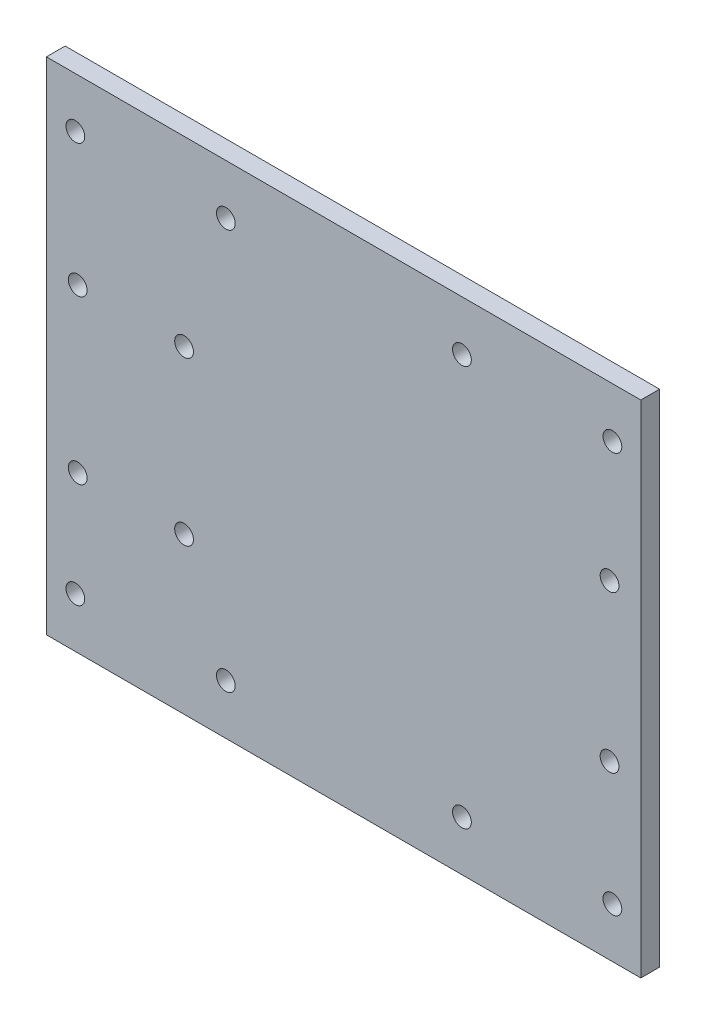
ISO-10303-21;
HEADER;
FILE_DESCRIPTION(('STEP AP214'),'2;1');
FILE_NAME('part.step','',(''),(''),'','','');
FILE_SCHEMA(('AUTOMOTIVE_DESIGN { 1 0 10303 214 1 1 1 1 }'));
ENDSEC;
DATA;
#1=APPLICATION_CONTEXT('core data for automotive mechanical design processes');
#2=APPLICATION_PROTOCOL_DEFINITION('international standard','automotive_design',2000,#1);
#3=PRODUCT_CONTEXT('',#1,'mechanical');
#4=PRODUCT('Part','Part','',(#3));
#5=PRODUCT_RELATED_PRODUCT_CATEGORY('part','',(#4));
#6=PRODUCT_DEFINITION_FORMATION('','',#4);
#7=PRODUCT_DEFINITION_CONTEXT('part definition',#1,'design');
#8=PRODUCT_DEFINITION('design','',#6,#7);
#9=PRODUCT_DEFINITION_SHAPE('','',#8);
#10=(LENGTH_UNIT() NAMED_UNIT(*) SI_UNIT(.MILLI.,.METRE.));
#11=(NAMED_UNIT(*) PLANE_ANGLE_UNIT() SI_UNIT($,.RADIAN.));
#12=(NAMED_UNIT(*) SI_UNIT($,.STERADIAN.) SOLID_ANGLE_UNIT());
#13=UNCERTAINTY_MEASURE_WITH_UNIT(LENGTH_MEASURE(1.E-05),#10,'distance_accuracy_value','');
#14=(GEOMETRIC_REPRESENTATION_CONTEXT(3) GLOBAL_UNCERTAINTY_ASSIGNED_CONTEXT((#13)) GLOBAL_UNIT_ASSIGNED_CONTEXT((#10,
#11,#12)) REPRESENTATION_CONTEXT('',''));
#15=CARTESIAN_POINT('',(0.,0.,0.));
#16=DIRECTION('',(0.,0.,1.));
#17=DIRECTION('',(1.,0.,0.));
#18=AXIS2_PLACEMENT_3D('',#15,#16,#17);
#19=CARTESIAN_POINT('',(47.5,-40.,3.));
#20=DIRECTION('',(-1.,0.,0.));
#21=DIRECTION('',(0.,0.,1.));
#22=AXIS2_PLACEMENT_3D('',#19,#20,#21);
#23=PLANE('',#22);
#24=DIRECTION('',(0.,1.,0.));
#25=VECTOR('',#24,1.);
#26=CARTESIAN_POINT('',(47.5,-40.,0.));
#27=LINE('',#26,#25);
#28=CARTESIAN_POINT('',(47.5,-40.,0.));
#29=VERTEX_POINT('',#28);
#30=CARTESIAN_POINT('',(47.5,40.,0.));
#31=VERTEX_POINT('',#30);
#32=EDGE_CURVE('E100',#29,#31,#27,.T.);
#33=ORIENTED_EDGE('',*,*,#32,.T.);
#34=DIRECTION('',(0.,0.,-1.));
#35=VECTOR('',#34,1.);
#36=CARTESIAN_POINT('',(47.5,40.,3.));
#37=LINE('',#36,#35);
#38=CARTESIAN_POINT('',(47.5,40.,3.));
#39=VERTEX_POINT('',#38);
#40=EDGE_CURVE('E11',#39,#31,#37,.T.);
#41=ORIENTED_EDGE('',*,*,#40,.F.);
#42=DIRECTION('',(0.,1.,0.));
#43=VECTOR('',#42,1.);
#44=CARTESIAN_POINT('',(47.5,-40.,3.));
#45=LINE('',#44,#43);
#46=CARTESIAN_POINT('',(47.5,-40.,3.));
#47=VERTEX_POINT('',#46);
#48=EDGE_CURVE('E88',#47,#39,#45,.T.);
#49=ORIENTED_EDGE('',*,*,#48,.F.);
#50=DIRECTION('',(0.,0.,-1.));
#51=VECTOR('',#50,1.);
#52=CARTESIAN_POINT('',(47.5,-40.,3.));
#53=LINE('',#52,#51);
#54=EDGE_CURVE('E96',#47,#29,#53,.T.);
#55=ORIENTED_EDGE('',*,*,#54,.T.);
#56=EDGE_LOOP('',(#33,#41,#49,#55));
#57=FACE_BOUND('',#56,.T.);
#58=ADVANCED_FACE('F37',(#57),#23,.F.);
#59=CARTESIAN_POINT('',(-47.5,40.,3.));
#60=DIRECTION('',(0.,-1.,0.));
#61=DIRECTION('',(0.,0.,-1.));
#62=AXIS2_PLACEMENT_3D('',#59,#60,#61);
#63=PLANE('',#62);
#64=DIRECTION('',(-1.,0.,0.));
#65=VECTOR('',#64,1.);
#66=CARTESIAN_POINT('',(-47.5,40.,0.));
#67=LINE('',#66,#65);
#68=CARTESIAN_POINT('',(-47.5,40.,0.));
#69=VERTEX_POINT('',#68);
#70=EDGE_CURVE('E92',#31,#69,#67,.T.);
#71=ORIENTED_EDGE('',*,*,#70,.T.);
#72=DIRECTION('',(0.,0.,-1.));
#73=VECTOR('',#72,1.);
#74=CARTESIAN_POINT('',(-47.5,40.,3.));
#75=LINE('',#74,#73);
#76=CARTESIAN_POINT('',(-47.5,40.,3.));
#77=VERTEX_POINT('',#76);
#78=EDGE_CURVE('E45',#77,#69,#75,.T.);
#79=ORIENTED_EDGE('',*,*,#78,.F.);
#80=DIRECTION('',(-1.,0.,0.));
#81=VECTOR('',#80,1.);
#82=CARTESIAN_POINT('',(-47.5,40.,3.));
#83=LINE('',#82,#81);
#84=EDGE_CURVE('E83',#39,#77,#83,.T.);
#85=ORIENTED_EDGE('',*,*,#84,.F.);
#86=ORIENTED_EDGE('',*,*,#40,.T.);
#87=EDGE_LOOP('',(#71,#79,#85,#86));
#88=FACE_BOUND('',#87,.T.);
#89=ADVANCED_FACE('F91',(#88),#63,.F.);
#90=CARTESIAN_POINT('',(-47.5,-40.,3.));
#91=DIRECTION('',(1.,0.,0.));
#92=DIRECTION('',(0.,0.,-1.));
#93=AXIS2_PLACEMENT_3D('',#90,#91,#92);
#94=PLANE('',#93);
#95=DIRECTION('',(0.,-1.,0.));
#96=VECTOR('',#95,1.);
#97=CARTESIAN_POINT('',(-47.5,-40.,0.));
#98=LINE('',#97,#96);
#99=CARTESIAN_POINT('',(-47.5,-40.,0.));
#100=VERTEX_POINT('',#99);
#101=EDGE_CURVE('E70',#69,#100,#98,.T.);
#102=ORIENTED_EDGE('',*,*,#101,.T.);
#103=DIRECTION('',(0.,0.,-1.));
#104=VECTOR('',#103,1.);
#105=CARTESIAN_POINT('',(-47.5,-40.,3.));
#106=LINE('',#105,#104);
#107=CARTESIAN_POINT('',(-47.5,-40.,3.));
#108=VERTEX_POINT('',#107);
#109=EDGE_CURVE('E93',#108,#100,#106,.T.);
#110=ORIENTED_EDGE('',*,*,#109,.F.);
#111=DIRECTION('',(0.,-1.,0.));
#112=VECTOR('',#111,1.);
#113=CARTESIAN_POINT('',(-47.5,-40.,3.));
#114=LINE('',#113,#112);
#115=EDGE_CURVE('E86',#77,#108,#114,.T.);
#116=ORIENTED_EDGE('',*,*,#115,.F.);
#117=ORIENTED_EDGE('',*,*,#78,.T.);
#118=EDGE_LOOP('',(#102,#110,#116,#117));
#119=FACE_BOUND('',#118,.T.);
#120=ADVANCED_FACE('F94',(#119),#94,.F.);
#121=CARTESIAN_POINT('',(-47.5,-40.,3.));
#122=DIRECTION('',(0.,1.,0.));
#123=DIRECTION('',(0.,0.,1.));
#124=AXIS2_PLACEMENT_3D('',#121,#122,#123);
#125=PLANE('',#124);
#126=DIRECTION('',(1.,0.,0.));
#127=VECTOR('',#126,1.);
#128=CARTESIAN_POINT('',(-47.5,-40.,0.));
#129=LINE('',#128,#127);
#130=EDGE_CURVE('E76',#100,#29,#129,.T.);
#131=ORIENTED_EDGE('',*,*,#130,.T.);
#132=ORIENTED_EDGE('',*,*,#54,.F.);
#133=DIRECTION('',(1.,0.,0.));
#134=VECTOR('',#133,1.);
#135=CARTESIAN_POINT('',(-47.5,-40.,3.));
#136=LINE('',#135,#134);
#137=EDGE_CURVE('E53',#108,#47,#136,.T.);
#138=ORIENTED_EDGE('',*,*,#137,.F.);
#139=ORIENTED_EDGE('',*,*,#109,.T.);
#140=EDGE_LOOP('',(#131,#132,#138,#139));
#141=FACE_BOUND('',#140,.T.);
#142=ADVANCED_FACE('F108',(#141),#125,.F.);
#143=CARTESIAN_POINT('',(0.,0.,3.));
#144=DIRECTION('',(0.,0.,-1.));
#145=DIRECTION('',(-1.,0.,0.));
#146=AXIS2_PLACEMENT_3D('',#143,#144,#145);
#147=PLANE('',#146);
#148=CARTESIAN_POINT('',(42.5,12.5,3.));
#149=DIRECTION('',(0.,0.,1.));
#150=DIRECTION('',(1.,0.,0.));
#151=AXIS2_PLACEMENT_3D('',#148,#149,#150);
#152=CIRCLE('',#151,1.5);
#153=CARTESIAN_POINT('',(44.,12.5,3.));
#154=VERTEX_POINT('',#153);
#155=EDGE_CURVE('E144',#154,#154,#152,.T.);
#156=ORIENTED_EDGE('',*,*,#155,.F.);
#157=EDGE_LOOP('',(#156));
#158=FACE_BOUND('',#157,.T.);
#159=CARTESIAN_POINT('',(-25.5,-15.0723040504985,3.));
#160=DIRECTION('',(0.,0.,1.));
#161=DIRECTION('',(1.,0.,0.));
#162=AXIS2_PLACEMENT_3D('',#159,#160,#161);
#163=CIRCLE('',#162,1.5);
#164=CARTESIAN_POINT('',(-24.,-15.0723040504985,3.));
#165=VERTEX_POINT('',#164);
#166=EDGE_CURVE('E151',#165,#165,#163,.T.);
#167=ORIENTED_EDGE('',*,*,#166,.F.);
#168=EDGE_LOOP('',(#167));
#169=FACE_BOUND('',#168,.T.);
#170=CARTESIAN_POINT('',(-42.5,10.9276959495015,3.));
#171=DIRECTION('',(0.,0.,1.));
#172=DIRECTION('',(1.,0.,0.));
#173=AXIS2_PLACEMENT_3D('',#170,#171,#172);
#174=CIRCLE('',#173,1.5);
#175=CARTESIAN_POINT('',(-41.,10.9276959495015,3.));
#176=VERTEX_POINT('',#175);
#177=EDGE_CURVE('E157',#176,#176,#174,.T.);
#178=ORIENTED_EDGE('',*,*,#177,.F.);
#179=EDGE_LOOP('',(#178));
#180=FACE_BOUND('',#179,.T.);
#181=CARTESIAN_POINT('',(-42.5,-15.0723040504985,3.));
#182=DIRECTION('',(0.,0.,1.));
#183=DIRECTION('',(1.,0.,0.));
#184=AXIS2_PLACEMENT_3D('',#181,#182,#183);
#185=CIRCLE('',#184,1.5);
#186=CARTESIAN_POINT('',(-41.,-15.0723040504985,3.));
#187=VERTEX_POINT('',#186);
#188=EDGE_CURVE('E163',#187,#187,#185,.T.);
#189=ORIENTED_EDGE('',*,*,#188,.F.);
#190=EDGE_LOOP('',(#189));
#191=FACE_BOUND('',#190,.T.);
#192=CARTESIAN_POINT('',(-18.8256923476747,-32.,3.));
#193=DIRECTION('',(0.,0.,1.));
#194=DIRECTION('',(1.,0.,0.));
#195=AXIS2_PLACEMENT_3D('',#192,#193,#194);
#196=CIRCLE('',#195,1.5);
#197=CARTESIAN_POINT('',(-17.3256923476747,-32.,3.));
#198=VERTEX_POINT('',#197);
#199=EDGE_CURVE('E127',#198,#198,#196,.T.);
#200=ORIENTED_EDGE('',*,*,#199,.F.);
#201=EDGE_LOOP('',(#200));
#202=FACE_BOUND('',#201,.T.);
#203=CARTESIAN_POINT('',(-42.8756923476747,32.,3.));
#204=DIRECTION('',(0.,0.,1.));
#205=DIRECTION('',(1.,0.,0.));
#206=AXIS2_PLACEMENT_3D('',#203,#204,#205);
#207=CIRCLE('',#206,1.5);
#208=CARTESIAN_POINT('',(-41.3756923476747,32.,3.));
#209=VERTEX_POINT('',#208);
#210=EDGE_CURVE('E120',#209,#209,#207,.T.);
#211=ORIENTED_EDGE('',*,*,#210,.F.);
#212=EDGE_LOOP('',(#211));
#213=FACE_BOUND('',#212,.T.);
#214=CARTESIAN_POINT('',(-18.8256923476747,32.,3.));
#215=DIRECTION('',(0.,0.,1.));
#216=DIRECTION('',(1.,0.,0.));
#217=AXIS2_PLACEMENT_3D('',#214,#215,#216);
#218=CIRCLE('',#217,1.5);
#219=CARTESIAN_POINT('',(-17.3256923476747,32.,3.));
#220=VERTEX_POINT('',#219);
#221=EDGE_CURVE('E139',#220,#220,#218,.T.);
#222=ORIENTED_EDGE('',*,*,#221,.F.);
#223=EDGE_LOOP('',(#222));
#224=FACE_BOUND('',#223,.T.);
#225=CARTESIAN_POINT('',(-25.5,10.9276959495015,3.));
#226=DIRECTION('',(0.,0.,1.));
#227=DIRECTION('',(1.,0.,0.));
#228=AXIS2_PLACEMENT_3D('',#225,#226,#227);
#229=CIRCLE('',#228,1.5);
#230=CARTESIAN_POINT('',(-24.,10.9276959495015,3.));
#231=VERTEX_POINT('',#230);
#232=EDGE_CURVE('E132',#231,#231,#229,.T.);
#233=ORIENTED_EDGE('',*,*,#232,.F.);
#234=EDGE_LOOP('',(#233));
#235=FACE_BOUND('',#234,.T.);
#236=CARTESIAN_POINT('',(18.9096873240828,32.,3.));
#237=DIRECTION('',(0.,0.,1.));
#238=DIRECTION('',(1.,0.,0.));
#239=AXIS2_PLACEMENT_3D('',#236,#237,#238);
#240=CIRCLE('',#239,1.5);
#241=CARTESIAN_POINT('',(20.4096873240828,32.,3.));
#242=VERTEX_POINT('',#241);
#243=EDGE_CURVE('E192',#242,#242,#240,.T.);
#244=ORIENTED_EDGE('',*,*,#243,.F.);
#245=EDGE_LOOP('',(#244));
#246=FACE_BOUND('',#245,.T.);
#247=CARTESIAN_POINT('',(42.9596873240828,32.,3.));
#248=DIRECTION('',(0.,0.,1.));
#249=DIRECTION('',(1.,0.,0.));
#250=AXIS2_PLACEMENT_3D('',#247,#248,#249);
#251=CIRCLE('',#250,1.5);
#252=CARTESIAN_POINT('',(44.4596873240828,32.,3.));
#253=VERTEX_POINT('',#252);
#254=EDGE_CURVE('E175',#253,#253,#251,.T.);
#255=ORIENTED_EDGE('',*,*,#254,.F.);
#256=EDGE_LOOP('',(#255));
#257=FACE_BOUND('',#256,.T.);
#258=CARTESIAN_POINT('',(18.9096873240828,-32.,3.));
#259=DIRECTION('',(0.,0.,1.));
#260=DIRECTION('',(1.,0.,0.));
#261=AXIS2_PLACEMENT_3D('',#258,#259,#260);
#262=CIRCLE('',#261,1.5);
#263=CARTESIAN_POINT('',(20.4096873240828,-32.,3.));
#264=VERTEX_POINT('',#263);
#265=EDGE_CURVE('E168',#264,#264,#262,.T.);
#266=ORIENTED_EDGE('',*,*,#265,.F.);
#267=EDGE_LOOP('',(#266));
#268=FACE_BOUND('',#267,.T.);
#269=CARTESIAN_POINT('',(42.9596873240828,-32.,3.));
#270=DIRECTION('',(0.,0.,1.));
#271=DIRECTION('',(1.,0.,0.));
#272=AXIS2_PLACEMENT_3D('',#269,#270,#271);
#273=CIRCLE('',#272,1.5);
#274=CARTESIAN_POINT('',(44.4596873240828,-32.,3.));
#275=VERTEX_POINT('',#274);
#276=EDGE_CURVE('E187',#275,#275,#273,.T.);
#277=ORIENTED_EDGE('',*,*,#276,.F.);
#278=EDGE_LOOP('',(#277));
#279=FACE_BOUND('',#278,.T.);
#280=CARTESIAN_POINT('',(42.5,-12.5,3.));
#281=DIRECTION('',(0.,0.,1.));
#282=DIRECTION('',(1.,0.,0.));
#283=AXIS2_PLACEMENT_3D('',#280,#281,#282);
#284=CIRCLE('',#283,1.5);
#285=CARTESIAN_POINT('',(44.,-12.5,3.));
#286=VERTEX_POINT('',#285);
#287=EDGE_CURVE('E180',#286,#286,#284,.T.);
#288=ORIENTED_EDGE('',*,*,#287,.F.);
#289=EDGE_LOOP('',(#288));
#290=FACE_BOUND('',#289,.T.);
#291=CARTESIAN_POINT('',(-42.8756923476747,-32.,3.));
#292=DIRECTION('',(0.,0.,1.));
#293=DIRECTION('',(1.,0.,0.));
#294=AXIS2_PLACEMENT_3D('',#291,#292,#293);
#295=CIRCLE('',#294,1.5);
#296=CARTESIAN_POINT('',(-41.3756923476747,-32.,3.));
#297=VERTEX_POINT('',#296);
#298=EDGE_CURVE('E114',#297,#297,#295,.T.);
#299=ORIENTED_EDGE('',*,*,#298,.F.);
#300=EDGE_LOOP('',(#299));
#301=FACE_BOUND('',#300,.T.);
#302=ORIENTED_EDGE('',*,*,#48,.T.);
#303=ORIENTED_EDGE('',*,*,#84,.T.);
#304=ORIENTED_EDGE('',*,*,#115,.T.);
#305=ORIENTED_EDGE('',*,*,#137,.T.);
#306=EDGE_LOOP('',(#302,#303,#304,#305));
#307=FACE_BOUND('',#306,.T.);
#308=ADVANCED_FACE('F84',(#158,#169,#180,#191,#202,#213,#224,#235,#246,#257,#268,#279,#290,#301,
#307),#147,.F.);
#309=CARTESIAN_POINT('',(0.,0.,0.));
#310=DIRECTION('',(0.,0.,-1.));
#311=DIRECTION('',(-1.,0.,0.));
#312=AXIS2_PLACEMENT_3D('',#309,#310,#311);
#313=PLANE('',#312);
#314=CARTESIAN_POINT('',(42.5,12.5,0.));
#315=DIRECTION('',(0.,0.,1.));
#316=DIRECTION('',(1.,0.,0.));
#317=AXIS2_PLACEMENT_3D('',#314,#315,#316);
#318=CIRCLE('',#317,1.5);
#319=CARTESIAN_POINT('',(44.,12.5,0.));
#320=VERTEX_POINT('',#319);
#321=EDGE_CURVE('E147',#320,#320,#318,.T.);
#322=ORIENTED_EDGE('',*,*,#321,.T.);
#323=EDGE_LOOP('',(#322));
#324=FACE_BOUND('',#323,.T.);
#325=CARTESIAN_POINT('',(-25.5,-15.0723040504985,0.));
#326=DIRECTION('',(0.,0.,1.));
#327=DIRECTION('',(1.,0.,0.));
#328=AXIS2_PLACEMENT_3D('',#325,#326,#327);
#329=CIRCLE('',#328,1.5);
#330=CARTESIAN_POINT('',(-24.,-15.0723040504985,0.));
#331=VERTEX_POINT('',#330);
#332=EDGE_CURVE('E154',#331,#331,#329,.T.);
#333=ORIENTED_EDGE('',*,*,#332,.T.);
#334=EDGE_LOOP('',(#333));
#335=FACE_BOUND('',#334,.T.);
#336=CARTESIAN_POINT('',(-42.5,10.9276959495015,0.));
#337=DIRECTION('',(0.,0.,1.));
#338=DIRECTION('',(1.,0.,0.));
#339=AXIS2_PLACEMENT_3D('',#336,#337,#338);
#340=CIRCLE('',#339,1.5);
#341=CARTESIAN_POINT('',(-41.,10.9276959495015,0.));
#342=VERTEX_POINT('',#341);
#343=EDGE_CURVE('E160',#342,#342,#340,.T.);
#344=ORIENTED_EDGE('',*,*,#343,.T.);
#345=EDGE_LOOP('',(#344));
#346=FACE_BOUND('',#345,.T.);
#347=CARTESIAN_POINT('',(-42.5,-15.0723040504985,0.));
#348=DIRECTION('',(0.,0.,1.));
#349=DIRECTION('',(1.,0.,0.));
#350=AXIS2_PLACEMENT_3D('',#347,#348,#349);
#351=CIRCLE('',#350,1.5);
#352=CARTESIAN_POINT('',(-41.,-15.0723040504985,0.));
#353=VERTEX_POINT('',#352);
#354=EDGE_CURVE('E136',#353,#353,#351,.T.);
#355=ORIENTED_EDGE('',*,*,#354,.T.);
#356=EDGE_LOOP('',(#355));
#357=FACE_BOUND('',#356,.T.);
#358=CARTESIAN_POINT('',(-18.8256923476747,-32.,0.));
#359=DIRECTION('',(0.,0.,1.));
#360=DIRECTION('',(1.,0.,0.));
#361=AXIS2_PLACEMENT_3D('',#358,#359,#360);
#362=CIRCLE('',#361,1.5);
#363=CARTESIAN_POINT('',(-17.3256923476747,-32.,0.));
#364=VERTEX_POINT('',#363);
#365=EDGE_CURVE('E117',#364,#364,#362,.T.);
#366=ORIENTED_EDGE('',*,*,#365,.T.);
#367=EDGE_LOOP('',(#366));
#368=FACE_BOUND('',#367,.T.);
#369=CARTESIAN_POINT('',(-42.8756923476747,32.,0.));
#370=DIRECTION('',(0.,0.,1.));
#371=DIRECTION('',(1.,0.,0.));
#372=AXIS2_PLACEMENT_3D('',#369,#370,#371);
#373=CIRCLE('',#372,1.5);
#374=CARTESIAN_POINT('',(-41.3756923476747,32.,0.));
#375=VERTEX_POINT('',#374);
#376=EDGE_CURVE('E123',#375,#375,#373,.T.);
#377=ORIENTED_EDGE('',*,*,#376,.T.);
#378=EDGE_LOOP('',(#377));
#379=FACE_BOUND('',#378,.T.);
#380=CARTESIAN_POINT('',(-18.8256923476747,32.,0.));
#381=DIRECTION('',(0.,0.,1.));
#382=DIRECTION('',(1.,0.,0.));
#383=AXIS2_PLACEMENT_3D('',#380,#381,#382);
#384=CIRCLE('',#383,1.5);
#385=CARTESIAN_POINT('',(-17.3256923476747,32.,0.));
#386=VERTEX_POINT('',#385);
#387=EDGE_CURVE('E124',#386,#386,#384,.T.);
#388=ORIENTED_EDGE('',*,*,#387,.T.);
#389=EDGE_LOOP('',(#388));
#390=FACE_BOUND('',#389,.T.);
#391=CARTESIAN_POINT('',(-25.5,10.9276959495015,0.));
#392=DIRECTION('',(0.,0.,1.));
#393=DIRECTION('',(1.,0.,0.));
#394=AXIS2_PLACEMENT_3D('',#391,#392,#393);
#395=CIRCLE('',#394,1.5);
#396=CARTESIAN_POINT('',(-24.,10.9276959495015,0.));
#397=VERTEX_POINT('',#396);
#398=EDGE_CURVE('E135',#397,#397,#395,.T.);
#399=ORIENTED_EDGE('',*,*,#398,.T.);
#400=EDGE_LOOP('',(#399));
#401=FACE_BOUND('',#400,.T.);
#402=CARTESIAN_POINT('',(18.9096873240828,32.,0.));
#403=DIRECTION('',(0.,0.,1.));
#404=DIRECTION('',(1.,0.,0.));
#405=AXIS2_PLACEMENT_3D('',#402,#403,#404);
#406=CIRCLE('',#405,1.5);
#407=CARTESIAN_POINT('',(20.4096873240828,32.,0.));
#408=VERTEX_POINT('',#407);
#409=EDGE_CURVE('E184',#408,#408,#406,.T.);
#410=ORIENTED_EDGE('',*,*,#409,.T.);
#411=EDGE_LOOP('',(#410));
#412=FACE_BOUND('',#411,.T.);
#413=CARTESIAN_POINT('',(42.9596873240828,32.,0.));
#414=DIRECTION('',(0.,0.,1.));
#415=DIRECTION('',(1.,0.,0.));
#416=AXIS2_PLACEMENT_3D('',#413,#414,#415);
#417=CIRCLE('',#416,1.5);
#418=CARTESIAN_POINT('',(44.4596873240828,32.,0.));
#419=VERTEX_POINT('',#418);
#420=EDGE_CURVE('E148',#419,#419,#417,.T.);
#421=ORIENTED_EDGE('',*,*,#420,.T.);
#422=EDGE_LOOP('',(#421));
#423=FACE_BOUND('',#422,.T.);
#424=CARTESIAN_POINT('',(18.9096873240828,-32.,0.));
#425=DIRECTION('',(0.,0.,1.));
#426=DIRECTION('',(1.,0.,0.));
#427=AXIS2_PLACEMENT_3D('',#424,#425,#426);
#428=CIRCLE('',#427,1.5);
#429=CARTESIAN_POINT('',(20.4096873240828,-32.,0.));
#430=VERTEX_POINT('',#429);
#431=EDGE_CURVE('E171',#430,#430,#428,.T.);
#432=ORIENTED_EDGE('',*,*,#431,.T.);
#433=EDGE_LOOP('',(#432));
#434=FACE_BOUND('',#433,.T.);
#435=CARTESIAN_POINT('',(42.9596873240828,-32.,0.));
#436=DIRECTION('',(0.,0.,1.));
#437=DIRECTION('',(1.,0.,0.));
#438=AXIS2_PLACEMENT_3D('',#435,#436,#437);
#439=CIRCLE('',#438,1.5);
#440=CARTESIAN_POINT('',(44.4596873240828,-32.,0.));
#441=VERTEX_POINT('',#440);
#442=EDGE_CURVE('E172',#441,#441,#439,.T.);
#443=ORIENTED_EDGE('',*,*,#442,.T.);
#444=EDGE_LOOP('',(#443));
#445=FACE_BOUND('',#444,.T.);
#446=CARTESIAN_POINT('',(42.5,-12.5,0.));
#447=DIRECTION('',(0.,0.,1.));
#448=DIRECTION('',(1.,0.,0.));
#449=AXIS2_PLACEMENT_3D('',#446,#447,#448);
#450=CIRCLE('',#449,1.5);
#451=CARTESIAN_POINT('',(44.,-12.5,0.));
#452=VERTEX_POINT('',#451);
#453=EDGE_CURVE('E183',#452,#452,#450,.T.);
#454=ORIENTED_EDGE('',*,*,#453,.T.);
#455=EDGE_LOOP('',(#454));
#456=FACE_BOUND('',#455,.T.);
#457=CARTESIAN_POINT('',(-42.8756923476747,-32.,0.));
#458=DIRECTION('',(0.,0.,1.));
#459=DIRECTION('',(1.,0.,0.));
#460=AXIS2_PLACEMENT_3D('',#457,#458,#459);
#461=CIRCLE('',#460,1.5);
#462=CARTESIAN_POINT('',(-41.3756923476747,-32.,0.));
#463=VERTEX_POINT('',#462);
#464=EDGE_CURVE('E103',#463,#463,#461,.T.);
#465=ORIENTED_EDGE('',*,*,#464,.T.);
#466=EDGE_LOOP('',(#465));
#467=FACE_BOUND('',#466,.T.);
#468=ORIENTED_EDGE('',*,*,#32,.F.);
#469=ORIENTED_EDGE('',*,*,#130,.F.);
#470=ORIENTED_EDGE('',*,*,#101,.F.);
#471=ORIENTED_EDGE('',*,*,#70,.F.);
#472=EDGE_LOOP('',(#468,#469,#470,#471));
#473=FACE_BOUND('',#472,.T.);
#474=ADVANCED_FACE('F111',(#324,#335,#346,#357,#368,#379,#390,#401,#412,#423,#434,#445,#456,
#467,#473),#313,.T.);
#475=CARTESIAN_POINT('',(-42.8756923476747,-32.,0.));
#476=DIRECTION('',(0.,0.,1.));
#477=DIRECTION('',(1.,0.,0.));
#478=AXIS2_PLACEMENT_3D('',#475,#476,#477);
#479=CYLINDRICAL_SURFACE('',#478,1.5);
#480=ORIENTED_EDGE('',*,*,#464,.F.);
#481=EDGE_LOOP('',(#480));
#482=FACE_BOUND('',#481,.T.);
#483=ORIENTED_EDGE('',*,*,#298,.T.);
#484=EDGE_LOOP('',(#483));
#485=FACE_BOUND('',#484,.T.);
#486=ADVANCED_FACE('F222',(#482,#485),#479,.F.);
#487=CARTESIAN_POINT('',(42.5,-12.5,0.));
#488=DIRECTION('',(0.,0.,1.));
#489=DIRECTION('',(1.,0.,0.));
#490=AXIS2_PLACEMENT_3D('',#487,#488,#489);
#491=CYLINDRICAL_SURFACE('',#490,1.5);
#492=ORIENTED_EDGE('',*,*,#453,.F.);
#493=EDGE_LOOP('',(#492));
#494=FACE_BOUND('',#493,.T.);
#495=ORIENTED_EDGE('',*,*,#287,.T.);
#496=EDGE_LOOP('',(#495));
#497=FACE_BOUND('',#496,.T.);
#498=ADVANCED_FACE('F224',(#494,#497),#491,.F.);
#499=CARTESIAN_POINT('',(42.9596873240828,-32.,0.));
#500=DIRECTION('',(0.,0.,1.));
#501=DIRECTION('',(1.,0.,0.));
#502=AXIS2_PLACEMENT_3D('',#499,#500,#501);
#503=CYLINDRICAL_SURFACE('',#502,1.5);
#504=ORIENTED_EDGE('',*,*,#442,.F.);
#505=EDGE_LOOP('',(#504));
#506=FACE_BOUND('',#505,.T.);
#507=ORIENTED_EDGE('',*,*,#276,.T.);
#508=EDGE_LOOP('',(#507));
#509=FACE_BOUND('',#508,.T.);
#510=ADVANCED_FACE('F231',(#506,#509),#503,.F.);
#511=CARTESIAN_POINT('',(18.9096873240828,-32.,0.));
#512=DIRECTION('',(0.,0.,1.));
#513=DIRECTION('',(1.,0.,0.));
#514=AXIS2_PLACEMENT_3D('',#511,#512,#513);
#515=CYLINDRICAL_SURFACE('',#514,1.5);
#516=ORIENTED_EDGE('',*,*,#431,.F.);
#517=EDGE_LOOP('',(#516));
#518=FACE_BOUND('',#517,.T.);
#519=ORIENTED_EDGE('',*,*,#265,.T.);
#520=EDGE_LOOP('',(#519));
#521=FACE_BOUND('',#520,.T.);
#522=ADVANCED_FACE('F279',(#518,#521),#515,.F.);
#523=CARTESIAN_POINT('',(42.9596873240828,32.,0.));
#524=DIRECTION('',(0.,0.,1.));
#525=DIRECTION('',(1.,0.,0.));
#526=AXIS2_PLACEMENT_3D('',#523,#524,#525);
#527=CYLINDRICAL_SURFACE('',#526,1.5);
#528=ORIENTED_EDGE('',*,*,#420,.F.);
#529=EDGE_LOOP('',(#528));
#530=FACE_BOUND('',#529,.T.);
#531=ORIENTED_EDGE('',*,*,#254,.T.);
#532=EDGE_LOOP('',(#531));
#533=FACE_BOUND('',#532,.T.);
#534=ADVANCED_FACE('F204',(#530,#533),#527,.F.);
#535=CARTESIAN_POINT('',(18.9096873240828,32.,0.));
#536=DIRECTION('',(0.,0.,1.));
#537=DIRECTION('',(1.,0.,0.));
#538=AXIS2_PLACEMENT_3D('',#535,#536,#537);
#539=CYLINDRICAL_SURFACE('',#538,1.5);
#540=ORIENTED_EDGE('',*,*,#409,.F.);
#541=EDGE_LOOP('',(#540));
#542=FACE_BOUND('',#541,.T.);
#543=ORIENTED_EDGE('',*,*,#243,.T.);
#544=EDGE_LOOP('',(#543));
#545=FACE_BOUND('',#544,.T.);
#546=ADVANCED_FACE('F200',(#542,#545),#539,.F.);
#547=CARTESIAN_POINT('',(-25.5,10.9276959495015,0.));
#548=DIRECTION('',(0.,0.,1.));
#549=DIRECTION('',(1.,0.,0.));
#550=AXIS2_PLACEMENT_3D('',#547,#548,#549);
#551=CYLINDRICAL_SURFACE('',#550,1.5);
#552=ORIENTED_EDGE('',*,*,#398,.F.);
#553=EDGE_LOOP('',(#552));
#554=FACE_BOUND('',#553,.T.);
#555=ORIENTED_EDGE('',*,*,#232,.T.);
#556=EDGE_LOOP('',(#555));
#557=FACE_BOUND('',#556,.T.);
#558=ADVANCED_FACE('F203',(#554,#557),#551,.F.);
#559=CARTESIAN_POINT('',(-18.8256923476747,32.,0.));
#560=DIRECTION('',(0.,0.,1.));
#561=DIRECTION('',(1.,0.,0.));
#562=AXIS2_PLACEMENT_3D('',#559,#560,#561);
#563=CYLINDRICAL_SURFACE('',#562,1.5);
#564=ORIENTED_EDGE('',*,*,#387,.F.);
#565=EDGE_LOOP('',(#564));
#566=FACE_BOUND('',#565,.T.);
#567=ORIENTED_EDGE('',*,*,#221,.T.);
#568=EDGE_LOOP('',(#567));
#569=FACE_BOUND('',#568,.T.);
#570=ADVANCED_FACE('F313',(#566,#569),#563,.F.);
#571=CARTESIAN_POINT('',(-42.8756923476747,32.,0.));
#572=DIRECTION('',(0.,0.,1.));
#573=DIRECTION('',(1.,0.,0.));
#574=AXIS2_PLACEMENT_3D('',#571,#572,#573);
#575=CYLINDRICAL_SURFACE('',#574,1.5);
#576=ORIENTED_EDGE('',*,*,#376,.F.);
#577=EDGE_LOOP('',(#576));
#578=FACE_BOUND('',#577,.T.);
#579=ORIENTED_EDGE('',*,*,#210,.T.);
#580=EDGE_LOOP('',(#579));
#581=FACE_BOUND('',#580,.T.);
#582=ADVANCED_FACE('F323',(#578,#581),#575,.F.);
#583=CARTESIAN_POINT('',(-18.8256923476747,-32.,0.));
#584=DIRECTION('',(0.,0.,1.));
#585=DIRECTION('',(1.,0.,0.));
#586=AXIS2_PLACEMENT_3D('',#583,#584,#585);
#587=CYLINDRICAL_SURFACE('',#586,1.5);
#588=ORIENTED_EDGE('',*,*,#365,.F.);
#589=EDGE_LOOP('',(#588));
#590=FACE_BOUND('',#589,.T.);
#591=ORIENTED_EDGE('',*,*,#199,.T.);
#592=EDGE_LOOP('',(#591));
#593=FACE_BOUND('',#592,.T.);
#594=ADVANCED_FACE('F333',(#590,#593),#587,.F.);
#595=CARTESIAN_POINT('',(-42.5,-15.0723040504985,0.));
#596=DIRECTION('',(0.,0.,1.));
#597=DIRECTION('',(1.,0.,0.));
#598=AXIS2_PLACEMENT_3D('',#595,#596,#597);
#599=CYLINDRICAL_SURFACE('',#598,1.5);
#600=ORIENTED_EDGE('',*,*,#354,.F.);
#601=EDGE_LOOP('',(#600));
#602=FACE_BOUND('',#601,.T.);
#603=ORIENTED_EDGE('',*,*,#188,.T.);
#604=EDGE_LOOP('',(#603));
#605=FACE_BOUND('',#604,.T.);
#606=ADVANCED_FACE('F342',(#602,#605),#599,.F.);
#607=CARTESIAN_POINT('',(-42.5,10.9276959495015,0.));
#608=DIRECTION('',(0.,0.,1.));
#609=DIRECTION('',(1.,0.,0.));
#610=AXIS2_PLACEMENT_3D('',#607,#608,#609);
#611=CYLINDRICAL_SURFACE('',#610,1.5);
#612=ORIENTED_EDGE('',*,*,#343,.F.);
#613=EDGE_LOOP('',(#612));
#614=FACE_BOUND('',#613,.T.);
#615=ORIENTED_EDGE('',*,*,#177,.T.);
#616=EDGE_LOOP('',(#615));
#617=FACE_BOUND('',#616,.T.);
#618=ADVANCED_FACE('F352',(#614,#617),#611,.F.);
#619=CARTESIAN_POINT('',(-25.5,-15.0723040504985,0.));
#620=DIRECTION('',(0.,0.,1.));
#621=DIRECTION('',(1.,0.,0.));
#622=AXIS2_PLACEMENT_3D('',#619,#620,#621);
#623=CYLINDRICAL_SURFACE('',#622,1.5);
#624=ORIENTED_EDGE('',*,*,#332,.F.);
#625=EDGE_LOOP('',(#624));
#626=FACE_BOUND('',#625,.T.);
#627=ORIENTED_EDGE('',*,*,#166,.T.);
#628=EDGE_LOOP('',(#627));
#629=FACE_BOUND('',#628,.T.);
#630=ADVANCED_FACE('F362',(#626,#629),#623,.F.);
#631=CARTESIAN_POINT('',(42.5,12.5,0.));
#632=DIRECTION('',(0.,0.,1.));
#633=DIRECTION('',(1.,0.,0.));
#634=AXIS2_PLACEMENT_3D('',#631,#632,#633);
#635=CYLINDRICAL_SURFACE('',#634,1.5);
#636=ORIENTED_EDGE('',*,*,#321,.F.);
#637=EDGE_LOOP('',(#636));
#638=FACE_BOUND('',#637,.T.);
#639=ORIENTED_EDGE('',*,*,#155,.T.);
#640=EDGE_LOOP('',(#639));
#641=FACE_BOUND('',#640,.T.);
#642=ADVANCED_FACE('F372',(#638,#641),#635,.F.);
#643=CLOSED_SHELL('',(#58,#89,#120,#142,#308,#474,#486,#498,#510,#522,#534,#546,#558,#570,#582,
#594,#606,#618,#630,#642));
#644=MANIFOLD_SOLID_BREP('B2',#643);
#645=ADVANCED_BREP_SHAPE_REPRESENTATION('',(#18,#644),#14);
#646=SHAPE_DEFINITION_REPRESENTATION(#9,#645);
ENDSEC;
END-ISO-10303-21;
